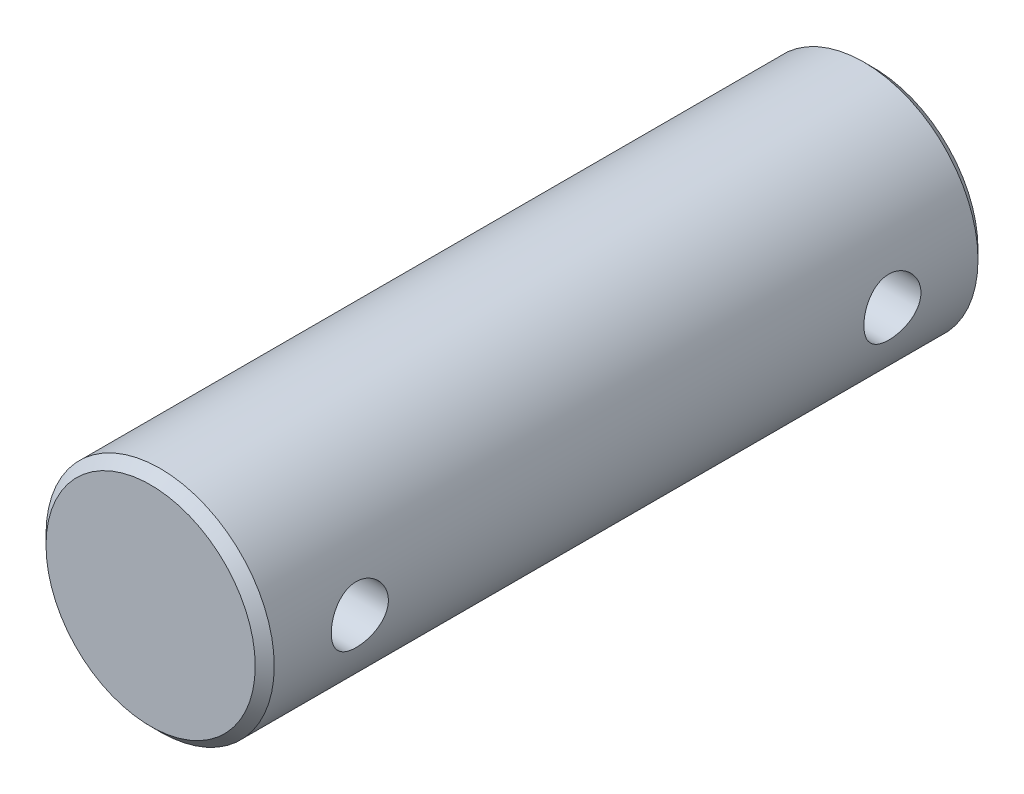
ISO-10303-21;
HEADER;
FILE_DESCRIPTION(('STEP AP214'),'2;1');
FILE_NAME('part.step','',(''),(''),'','','');
FILE_SCHEMA(('AUTOMOTIVE_DESIGN { 1 0 10303 214 1 1 1 1 }'));
ENDSEC;
DATA;
#1=APPLICATION_CONTEXT('core data for automotive mechanical design processes');
#2=APPLICATION_PROTOCOL_DEFINITION('international standard','automotive_design',2000,#1);
#3=PRODUCT_CONTEXT('',#1,'mechanical');
#4=PRODUCT('Part','Part','',(#3));
#5=PRODUCT_RELATED_PRODUCT_CATEGORY('part','',(#4));
#6=PRODUCT_DEFINITION_FORMATION('','',#4);
#7=PRODUCT_DEFINITION_CONTEXT('part definition',#1,'design');
#8=PRODUCT_DEFINITION('design','',#6,#7);
#9=PRODUCT_DEFINITION_SHAPE('','',#8);
#10=(LENGTH_UNIT() NAMED_UNIT(*) SI_UNIT(.MILLI.,.METRE.));
#11=(NAMED_UNIT(*) PLANE_ANGLE_UNIT() SI_UNIT($,.RADIAN.));
#12=(NAMED_UNIT(*) SI_UNIT($,.STERADIAN.) SOLID_ANGLE_UNIT());
#13=UNCERTAINTY_MEASURE_WITH_UNIT(LENGTH_MEASURE(1.E-05),#10,'distance_accuracy_value','');
#14=(GEOMETRIC_REPRESENTATION_CONTEXT(3) GLOBAL_UNCERTAINTY_ASSIGNED_CONTEXT((#13)) GLOBAL_UNIT_ASSIGNED_CONTEXT((#10,
#11,#12)) REPRESENTATION_CONTEXT('',''));
#15=CARTESIAN_POINT('',(0.,0.,0.));
#16=DIRECTION('',(0.,0.,1.));
#17=DIRECTION('',(1.,0.,0.));
#18=AXIS2_PLACEMENT_3D('',#15,#16,#17);
#19=CARTESIAN_POINT('',(0.,0.,-38.));
#20=DIRECTION('',(0.,0.,1.));
#21=DIRECTION('',(1.,0.,0.));
#22=AXIS2_PLACEMENT_3D('',#19,#20,#21);
#23=CYLINDRICAL_SURFACE('',#22,6.);
#24=CARTESIAN_POINT('',(-6.,0.,-6.5));
#25=CARTESIAN_POINT('',(-5.99999859868013,-0.0828760886697311,-6.49999767426184));
#26=CARTESIAN_POINT('',(-5.99826578131828,-0.165778157830763,-6.49310844922621));
#27=CARTESIAN_POINT('',(-5.99152113829892,-0.329206323770533,-6.465774848693));
#28=CARTESIAN_POINT('',(-5.98650745419968,-0.409731046870739,-6.44532279046215));
#29=CARTESIAN_POINT('',(-5.9737562633204,-0.566020872182577,-6.39156074653791));
#30=CARTESIAN_POINT('',(-5.96602202842087,-0.641791563430003,-6.35826620128472));
#31=CARTESIAN_POINT('',(-5.94865343807593,-0.786672131904427,-6.27981860995517));
#32=CARTESIAN_POINT('',(-5.9390190185405,-0.855781784348759,-6.23466516388106));
#33=CARTESIAN_POINT('',(-5.91867413591801,-0.98680192730092,-6.13279921034579));
#34=CARTESIAN_POINT('',(-5.90794707148533,-1.04855569006107,-6.07588842504082));
#35=CARTESIAN_POINT('',(-5.88673620117529,-1.1617489272033,-5.95254779509108));
#36=CARTESIAN_POINT('',(-5.87625242288348,-1.21318723694913,-5.8861168770535));
#37=CARTESIAN_POINT('',(-5.8565477569971,-1.30502654279903,-5.74440477326256));
#38=CARTESIAN_POINT('',(-5.84734794470605,-1.34525221592536,-5.6690067691896));
#39=CARTESIAN_POINT('',(-5.83149494812223,-1.41239690855053,-5.51225158834164));
#40=CARTESIAN_POINT('',(-5.82484135672789,-1.43931805543933,-5.43089536667424));
#41=CARTESIAN_POINT('',(-5.81500476717551,-1.47855483680429,-5.26625650179753));
#42=CARTESIAN_POINT('',(-5.81175491075426,-1.49115226833334,-5.1830451039502));
#43=CARTESIAN_POINT('',(-5.80889362537741,-1.50226177506785,-5.01563143098602));
#44=CARTESIAN_POINT('',(-5.80928160448644,-1.50077614181798,-4.93142931930139));
#45=CARTESIAN_POINT('',(-5.81359205496618,-1.48398652463928,-4.76658419225552));
#46=CARTESIAN_POINT('',(-5.81742863001879,-1.46901834019052,-4.6859043785349));
#47=CARTESIAN_POINT('',(-5.82806709676483,-1.42622418690311,-4.52823894908871));
#48=CARTESIAN_POINT('',(-5.83486919970696,-1.39839730206942,-4.45125359697102));
#49=CARTESIAN_POINT('',(-5.85075113904186,-1.33038947793715,-4.30226198374793));
#50=CARTESIAN_POINT('',(-5.85985327469421,-1.29008666723291,-4.23031382821045));
#51=CARTESIAN_POINT('',(-5.87929710846386,-1.19835627601496,-4.09408129024316));
#52=CARTESIAN_POINT('',(-5.88963902334735,-1.14692674880884,-4.02979825193274));
#53=CARTESIAN_POINT('',(-5.91075880539781,-1.03266342468122,-3.9087963843056));
#54=CARTESIAN_POINT('',(-5.92154069477971,-0.969546258165861,-3.85234550993865));
#55=CARTESIAN_POINT('',(-5.94205965578786,-0.834611917503701,-3.7507787575361));
#56=CARTESIAN_POINT('',(-5.95179669549415,-0.762794477707945,-3.70566322573643));
#57=CARTESIAN_POINT('',(-5.96917732094182,-0.612115888681392,-3.62794941377561));
#58=CARTESIAN_POINT('',(-5.97681360127725,-0.533231393208624,-3.59539465974557));
#59=CARTESIAN_POINT('',(-5.98907916991418,-0.370876008142883,-3.54408269429043));
#60=CARTESIAN_POINT('',(-5.99370903339281,-0.287405999150485,-3.52532284358186));
#61=CARTESIAN_POINT('',(-5.99935499271374,-0.120539970390027,-3.50254243444116));
#62=CARTESIAN_POINT('',(-6.00046053508279,-0.03719671998821,-3.4981569739247));
#63=CARTESIAN_POINT('',(-5.99918804814451,0.129032874801508,-3.50324900205549));
#64=CARTESIAN_POINT('',(-5.99681033241846,0.211919259644595,-3.51272524279913));
#65=CARTESIAN_POINT('',(-5.98889581127357,0.373614268776492,-3.54497090839138));
#66=CARTESIAN_POINT('',(-5.98340634185811,0.452465118968754,-3.56754126347699));
#67=CARTESIAN_POINT('',(-5.96988706634134,0.605257292452511,-3.62510708402845));
#68=CARTESIAN_POINT('',(-5.96185700369892,0.679198119032635,-3.66010380431317));
#69=CARTESIAN_POINT('',(-5.9439330792631,0.821523134429847,-3.74223612887473));
#70=CARTESIAN_POINT('',(-5.93400867366932,0.88978544183583,-3.78957611239676));
#71=CARTESIAN_POINT('',(-5.91344509187419,1.01752661364325,-3.89478990879697));
#72=CARTESIAN_POINT('',(-5.90280579251705,1.07700395897301,-3.95266553961691));
#73=CARTESIAN_POINT('',(-5.88168956960771,1.18699056807273,-4.07900196084446));
#74=CARTESIAN_POINT('',(-5.87122304187281,1.23724386762203,-4.14768770300242));
#75=CARTESIAN_POINT('',(-5.85192878377239,1.3255107590127,-4.29273263446572));
#76=CARTESIAN_POINT('',(-5.84310098067026,1.36352489415794,-4.36909148295975));
#77=CARTESIAN_POINT('',(-5.82818094734665,1.42595142060929,-4.52690572241308));
#78=CARTESIAN_POINT('',(-5.82207255291905,1.45044439665407,-4.60832762834401));
#79=CARTESIAN_POINT('',(-5.81326744090183,1.48534565995378,-4.77430963788911));
#80=CARTESIAN_POINT('',(-5.81056997719936,1.49575702747866,-4.85886905103249));
#81=CARTESIAN_POINT('',(-5.80894901203957,1.50203859033399,-5.0261210238552));
#82=CARTESIAN_POINT('',(-5.80991932728264,1.49831789778012,-5.10879743512473));
#83=CARTESIAN_POINT('',(-5.81527909007843,1.47737727831287,-5.27230388866798));
#84=CARTESIAN_POINT('',(-5.81966846891857,1.46015762268677,-5.35313396801365));
#85=CARTESIAN_POINT('',(-5.83131260682722,1.41293131944279,-5.51020845906541));
#86=CARTESIAN_POINT('',(-5.83855015236309,1.38300140468038,-5.58647730524021));
#87=CARTESIAN_POINT('',(-5.85507755724829,1.31126491360507,-5.73296538271369));
#88=CARTESIAN_POINT('',(-5.86436770120773,1.26945669003419,-5.80318377318692));
#89=CARTESIAN_POINT('',(-5.88425634263512,1.17386774863714,-5.93755462900202));
#90=CARTESIAN_POINT('',(-5.89488264831757,1.11980316291226,-6.00150107342396));
#91=CARTESIAN_POINT('',(-5.91608027246286,1.00178937118974,-6.11954704479541));
#92=CARTESIAN_POINT('',(-5.9266515772706,0.937837821261146,-6.17364423011297));
#93=CARTESIAN_POINT('',(-5.94677655647663,0.800467586702591,-6.27141130856461));
#94=CARTESIAN_POINT('',(-5.95630833365868,0.726898422316387,-6.31487461367158));
#95=CARTESIAN_POINT('',(-5.97304924975118,0.573266059510477,-6.38874746294053));
#96=CARTESIAN_POINT('',(-5.98026005199781,0.49320756343674,-6.41916636064854));
#97=CARTESIAN_POINT('',(-5.99048059565541,0.344410253243472,-6.46157183032965));
#98=CARTESIAN_POINT('',(-5.9940258505269,0.276380170908069,-6.47595124305343));
#99=CARTESIAN_POINT('',(-5.99878605231948,0.138906071536283,-6.49516594362194));
#100=CARTESIAN_POINT('',(-6.00000117450894,0.0694621612426164,-6.5000019493053));
#101=CARTESIAN_POINT('',(-6.,0.,-6.5));
#102=B_SPLINE_CURVE_WITH_KNOTS('',3,(#24,#25,#26,#27,#28,#29,#30,#31,#32,#33,#34,#35,#36,#37,
#38,#39,#40,#41,#42,#43,#44,#45,#46,#47,#48,#49,#50,#51,#52,#53,#54,#55,#56,#57,#58,#59,#60,#61,
#62,#63,#64,#65,#66,#67,#68,#69,#70,#71,#72,#73,#74,#75,#76,#77,#78,#79,#80,#81,#82,#83,#84,#85,
#86,#87,#88,#89,#90,#91,#92,#93,#94,#95,#96,#97,#98,#99,#100,#101),.UNSPECIFIED.,.T.,.F.,(4,2,2,
2,2,2,2,2,2,2,2,2,2,2,2,2,2,2,2,2,2,2,2,2,2,2,2,2,2,2,2,2,2,2,2,2,2,2,4),(0.,0.24837371247189,
0.4968882377639,0.745104902286106,0.993329940169328,1.24614435437139,1.49898729580062,
1.75558647545807,2.01214461169368,2.2635629509943,2.51494038112697,2.76022497007018,
3.00552703466038,3.25330527873879,3.50112690836163,3.75601500969019,4.01091089558247,
4.26668229009114,4.52240473688643,4.77158308949276,5.02073901112743,5.26620274514037,
5.51169127322291,5.76153587565352,6.01142363008019,6.26744509204476,6.52345518749508,
6.77792254614037,7.03233423252408,7.27943780398613,7.52653640956034,7.77216400559447,
8.01782568136901,8.2698957640991,8.52202569770418,8.77872185499588,9.0352336382135,
9.24342242942149,9.4515955604304),.UNSPECIFIED.);
#103=CARTESIAN_POINT('',(-6.,0.,-6.5));
#104=VERTEX_POINT('',#103);
#105=EDGE_CURVE('E10',#104,#104,#102,.T.);
#106=ORIENTED_EDGE('',*,*,#105,.F.);
#107=EDGE_LOOP('',(#106));
#108=FACE_BOUND('',#107,.T.);
#109=CARTESIAN_POINT('',(6.,0.,-6.5));
#110=CARTESIAN_POINT('',(5.99999859868013,0.0828760886697312,-6.49999767426184));
#111=CARTESIAN_POINT('',(5.99826578131828,0.165778157830763,-6.49310844922621));
#112=CARTESIAN_POINT('',(5.99152113829892,0.329206323770533,-6.465774848693));
#113=CARTESIAN_POINT('',(5.98650745419968,0.409731046870739,-6.44532279046215));
#114=CARTESIAN_POINT('',(5.9737562633204,0.566020872182577,-6.39156074653791));
#115=CARTESIAN_POINT('',(5.96602202842087,0.641791563430003,-6.35826620128472));
#116=CARTESIAN_POINT('',(5.94865343807593,0.786672131904427,-6.27981860995517));
#117=CARTESIAN_POINT('',(5.9390190185405,0.855781784348759,-6.23466516388106));
#118=CARTESIAN_POINT('',(5.91867413591801,0.98680192730092,-6.13279921034579));
#119=CARTESIAN_POINT('',(5.90794707148533,1.04855569006107,-6.07588842504082));
#120=CARTESIAN_POINT('',(5.88673620117529,1.1617489272033,-5.95254779509108));
#121=CARTESIAN_POINT('',(5.87625242288348,1.21318723694913,-5.8861168770535));
#122=CARTESIAN_POINT('',(5.8565477569971,1.30502654279903,-5.74440477326256));
#123=CARTESIAN_POINT('',(5.84734794470605,1.34525221592536,-5.6690067691896));
#124=CARTESIAN_POINT('',(5.83149494812223,1.41239690855053,-5.51225158834164));
#125=CARTESIAN_POINT('',(5.82484135672789,1.43931805543933,-5.43089536667424));
#126=CARTESIAN_POINT('',(5.81500476717551,1.47855483680429,-5.26625650179753));
#127=CARTESIAN_POINT('',(5.81175491075426,1.49115226833334,-5.1830451039502));
#128=CARTESIAN_POINT('',(5.80889362537741,1.50226177506785,-5.01563143098602));
#129=CARTESIAN_POINT('',(5.80928160448644,1.50077614181798,-4.93142931930139));
#130=CARTESIAN_POINT('',(5.81359205496618,1.48398652463928,-4.76658419225552));
#131=CARTESIAN_POINT('',(5.81742863001879,1.46901834019052,-4.6859043785349));
#132=CARTESIAN_POINT('',(5.82806709676483,1.42622418690311,-4.52823894908871));
#133=CARTESIAN_POINT('',(5.83486919970696,1.39839730206942,-4.45125359697102));
#134=CARTESIAN_POINT('',(5.85075113904186,1.33038947793715,-4.30226198374793));
#135=CARTESIAN_POINT('',(5.85985327469421,1.29008666723291,-4.23031382821045));
#136=CARTESIAN_POINT('',(5.87929710846386,1.19835627601496,-4.09408129024316));
#137=CARTESIAN_POINT('',(5.88963902334735,1.14692674880884,-4.02979825193274));
#138=CARTESIAN_POINT('',(5.91075880539781,1.03266342468122,-3.9087963843056));
#139=CARTESIAN_POINT('',(5.92154069477971,0.969546258165861,-3.85234550993865));
#140=CARTESIAN_POINT('',(5.94205965578786,0.834611917503701,-3.7507787575361));
#141=CARTESIAN_POINT('',(5.95179669549415,0.762794477707945,-3.70566322573643));
#142=CARTESIAN_POINT('',(5.96917732094182,0.612115888681392,-3.62794941377561));
#143=CARTESIAN_POINT('',(5.97681360127725,0.533231393208624,-3.59539465974557));
#144=CARTESIAN_POINT('',(5.98907916991418,0.370876008142883,-3.54408269429043));
#145=CARTESIAN_POINT('',(5.99370903339281,0.287405999150485,-3.52532284358186));
#146=CARTESIAN_POINT('',(5.99935499271374,0.120539970390027,-3.50254243444116));
#147=CARTESIAN_POINT('',(6.00046053508279,0.03719671998821,-3.4981569739247));
#148=CARTESIAN_POINT('',(5.99918804814451,-0.129032874801508,-3.50324900205549));
#149=CARTESIAN_POINT('',(5.99681033241846,-0.211919259644595,-3.51272524279913));
#150=CARTESIAN_POINT('',(5.98889581127357,-0.373614268776492,-3.54497090839138));
#151=CARTESIAN_POINT('',(5.98340634185811,-0.452465118968754,-3.56754126347699));
#152=CARTESIAN_POINT('',(5.96988706634134,-0.605257292452511,-3.62510708402845));
#153=CARTESIAN_POINT('',(5.96185700369892,-0.679198119032635,-3.66010380431317));
#154=CARTESIAN_POINT('',(5.9439330792631,-0.821523134429847,-3.74223612887473));
#155=CARTESIAN_POINT('',(5.93400867366932,-0.88978544183583,-3.78957611239676));
#156=CARTESIAN_POINT('',(5.91344509187419,-1.01752661364325,-3.89478990879697));
#157=CARTESIAN_POINT('',(5.90280579251705,-1.07700395897301,-3.95266553961691));
#158=CARTESIAN_POINT('',(5.88168956960771,-1.18699056807273,-4.07900196084446));
#159=CARTESIAN_POINT('',(5.87122304187281,-1.23724386762203,-4.14768770300242));
#160=CARTESIAN_POINT('',(5.85192878377239,-1.3255107590127,-4.29273263446572));
#161=CARTESIAN_POINT('',(5.84310098067026,-1.36352489415794,-4.36909148295975));
#162=CARTESIAN_POINT('',(5.82818094734665,-1.42595142060929,-4.52690572241308));
#163=CARTESIAN_POINT('',(5.82207255291905,-1.45044439665407,-4.60832762834401));
#164=CARTESIAN_POINT('',(5.81326744090183,-1.48534565995378,-4.77430963788911));
#165=CARTESIAN_POINT('',(5.81056997719936,-1.49575702747866,-4.85886905103249));
#166=CARTESIAN_POINT('',(5.80894901203957,-1.50203859033399,-5.0261210238552));
#167=CARTESIAN_POINT('',(5.80991932728264,-1.49831789778012,-5.10879743512473));
#168=CARTESIAN_POINT('',(5.81527909007843,-1.47737727831287,-5.27230388866798));
#169=CARTESIAN_POINT('',(5.81966846891857,-1.46015762268677,-5.35313396801365));
#170=CARTESIAN_POINT('',(5.83131260682722,-1.41293131944279,-5.51020845906541));
#171=CARTESIAN_POINT('',(5.83855015236309,-1.38300140468038,-5.58647730524021));
#172=CARTESIAN_POINT('',(5.85507755724829,-1.31126491360507,-5.73296538271369));
#173=CARTESIAN_POINT('',(5.86436770120773,-1.26945669003419,-5.80318377318692));
#174=CARTESIAN_POINT('',(5.88425634263512,-1.17386774863714,-5.93755462900202));
#175=CARTESIAN_POINT('',(5.89488264831757,-1.11980316291226,-6.00150107342396));
#176=CARTESIAN_POINT('',(5.91608027246286,-1.00178937118974,-6.11954704479541));
#177=CARTESIAN_POINT('',(5.9266515772706,-0.937837821261146,-6.17364423011297));
#178=CARTESIAN_POINT('',(5.94677655647663,-0.800467586702591,-6.27141130856461));
#179=CARTESIAN_POINT('',(5.95630833365868,-0.726898422316387,-6.31487461367158));
#180=CARTESIAN_POINT('',(5.97304924975118,-0.573266059510476,-6.38874746294053));
#181=CARTESIAN_POINT('',(5.98026005199781,-0.49320756343674,-6.41916636064854));
#182=CARTESIAN_POINT('',(5.99048059565541,-0.344410253243472,-6.46157183032965));
#183=CARTESIAN_POINT('',(5.9940258505269,-0.276380170908069,-6.47595124305343));
#184=CARTESIAN_POINT('',(5.99878605231948,-0.138906071536284,-6.49516594362194));
#185=CARTESIAN_POINT('',(6.00000117450894,-0.0694621612426165,-6.5000019493053));
#186=CARTESIAN_POINT('',(6.,0.,-6.5));
#187=B_SPLINE_CURVE_WITH_KNOTS('',3,(#109,#110,#111,#112,#113,#114,#115,#116,#117,#118,#119,
#120,#121,#122,#123,#124,#125,#126,#127,#128,#129,#130,#131,#132,#133,#134,#135,#136,#137,#138,
#139,#140,#141,#142,#143,#144,#145,#146,#147,#148,#149,#150,#151,#152,#153,#154,#155,#156,#157,
#158,#159,#160,#161,#162,#163,#164,#165,#166,#167,#168,#169,#170,#171,#172,#173,#174,#175,#176,
#177,#178,#179,#180,#181,#182,#183,#184,#185,#186),.UNSPECIFIED.,.T.,.F.,(4,2,2,2,2,2,2,2,2,2,2,
2,2,2,2,2,2,2,2,2,2,2,2,2,2,2,2,2,2,2,2,2,2,2,2,2,2,2,4),(0.,0.24837371247189,0.496888237763899,
0.745104902286106,0.993329940169328,1.24614435437139,1.49898729580062,1.75558647545807,
2.01214461169368,2.2635629509943,2.51494038112697,2.76022497007018,3.00552703466038,
3.25330527873879,3.50112690836163,3.75601500969019,4.01091089558247,4.26668229009114,
4.52240473688643,4.77158308949276,5.02073901112743,5.26620274514037,5.51169127322291,
5.76153587565352,6.01142363008019,6.26744509204476,6.52345518749508,6.77792254614037,
7.03233423252408,7.27943780398613,7.52653640956034,7.77216400559447,8.01782568136901,
8.2698957640991,8.52202569770418,8.77872185499588,9.0352336382135,9.24342242942149,
9.4515955604304),.UNSPECIFIED.);
#188=CARTESIAN_POINT('',(6.,0.,-6.5));
#189=VERTEX_POINT('',#188);
#190=EDGE_CURVE('E53',#189,#189,#187,.T.);
#191=ORIENTED_EDGE('',*,*,#190,.F.);
#192=EDGE_LOOP('',(#191));
#193=FACE_BOUND('',#192,.T.);
#194=CARTESIAN_POINT('',(-6.,0.,-34.5));
#195=CARTESIAN_POINT('',(-5.99999859868013,-0.0828760886697313,-34.4999976742618));
#196=CARTESIAN_POINT('',(-5.99826578131828,-0.165778157830763,-34.4931084492262));
#197=CARTESIAN_POINT('',(-5.99152113829892,-0.329206323770533,-34.465774848693));
#198=CARTESIAN_POINT('',(-5.98650745419968,-0.40973104687074,-34.4453227904622));
#199=CARTESIAN_POINT('',(-5.9737562633204,-0.566020872182578,-34.3915607465379));
#200=CARTESIAN_POINT('',(-5.96602202842087,-0.641791563430005,-34.3582662012847));
#201=CARTESIAN_POINT('',(-5.94865343807593,-0.786672131904429,-34.2798186099552));
#202=CARTESIAN_POINT('',(-5.9390190185405,-0.855781784348762,-34.2346651638811));
#203=CARTESIAN_POINT('',(-5.91867413591801,-0.986801927300925,-34.1327992103458));
#204=CARTESIAN_POINT('',(-5.90794707148533,-1.04855569006108,-34.0758884250408));
#205=CARTESIAN_POINT('',(-5.88673620117529,-1.16174892720331,-33.9525477950911));
#206=CARTESIAN_POINT('',(-5.87625242288348,-1.21318723694914,-33.8861168770535));
#207=CARTESIAN_POINT('',(-5.8565477569971,-1.30502654279904,-33.7444047732626));
#208=CARTESIAN_POINT('',(-5.84734794470605,-1.34525221592536,-33.6690067691896));
#209=CARTESIAN_POINT('',(-5.83149494812223,-1.41239690855053,-33.5122515883416));
#210=CARTESIAN_POINT('',(-5.82484135672789,-1.43931805543934,-33.4308953666742));
#211=CARTESIAN_POINT('',(-5.81500476717551,-1.47855483680429,-33.2662565017975));
#212=CARTESIAN_POINT('',(-5.81175491075426,-1.49115226833334,-33.1830451039502));
#213=CARTESIAN_POINT('',(-5.80889362537741,-1.50226177506786,-33.015631430986));
#214=CARTESIAN_POINT('',(-5.80928160448644,-1.50077614181798,-32.9314293193014));
#215=CARTESIAN_POINT('',(-5.81359205496618,-1.48398652463928,-32.7665841922555));
#216=CARTESIAN_POINT('',(-5.81742863001879,-1.46901834019053,-32.6859043785349));
#217=CARTESIAN_POINT('',(-5.82806709676483,-1.42622418690311,-32.5282389490887));
#218=CARTESIAN_POINT('',(-5.83486919970696,-1.39839730206943,-32.451253596971));
#219=CARTESIAN_POINT('',(-5.85075113904186,-1.33038947793716,-32.3022619837479));
#220=CARTESIAN_POINT('',(-5.85985327469421,-1.29008666723291,-32.2303138282104));
#221=CARTESIAN_POINT('',(-5.87929710846386,-1.19835627601496,-32.0940812902432));
#222=CARTESIAN_POINT('',(-5.88963902334735,-1.14692674880884,-32.0297982519327));
#223=CARTESIAN_POINT('',(-5.91075880539781,-1.03266342468122,-31.9087963843056));
#224=CARTESIAN_POINT('',(-5.92154069477971,-0.969546258165863,-31.8523455099387));
#225=CARTESIAN_POINT('',(-5.94205965578786,-0.834611917503706,-31.7507787575361));
#226=CARTESIAN_POINT('',(-5.95179669549415,-0.76279447770795,-31.7056632257364));
#227=CARTESIAN_POINT('',(-5.96917732094182,-0.612115888681399,-31.6279494137756));
#228=CARTESIAN_POINT('',(-5.97681360127725,-0.53323139320863,-31.5953946597456));
#229=CARTESIAN_POINT('',(-5.98907916991418,-0.370876008142888,-31.5440826942904));
#230=CARTESIAN_POINT('',(-5.99370903339281,-0.287405999150488,-31.5253228435819));
#231=CARTESIAN_POINT('',(-5.99935499271374,-0.120539970390028,-31.5025424344412));
#232=CARTESIAN_POINT('',(-6.00046053508279,-0.0371967199882104,-31.4981569739247));
#233=CARTESIAN_POINT('',(-5.99918804814451,0.129032874801508,-31.5032490020555));
#234=CARTESIAN_POINT('',(-5.99681033241846,0.211919259644594,-31.5127252427991));
#235=CARTESIAN_POINT('',(-5.98889581127357,0.373614268776491,-31.5449709083914));
#236=CARTESIAN_POINT('',(-5.98340634185811,0.452465118968755,-31.567541263477));
#237=CARTESIAN_POINT('',(-5.96988706634134,0.605257292452512,-31.6251070840284));
#238=CARTESIAN_POINT('',(-5.96185700369892,0.679198119032635,-31.6601038043132));
#239=CARTESIAN_POINT('',(-5.9439330792631,0.821523134429848,-31.7422361288747));
#240=CARTESIAN_POINT('',(-5.93400867366932,0.889785441835831,-31.7895761123968));
#241=CARTESIAN_POINT('',(-5.91344509187419,1.01752661364325,-31.894789908797));
#242=CARTESIAN_POINT('',(-5.90280579251705,1.07700395897301,-31.9526655396169));
#243=CARTESIAN_POINT('',(-5.88168956960771,1.18699056807273,-32.0790019608445));
#244=CARTESIAN_POINT('',(-5.87122304187281,1.23724386762204,-32.1476877030024));
#245=CARTESIAN_POINT('',(-5.85192878377239,1.3255107590127,-32.2927326344657));
#246=CARTESIAN_POINT('',(-5.84310098067026,1.36352489415794,-32.3690914829598));
#247=CARTESIAN_POINT('',(-5.82818094734665,1.4259514206093,-32.5269057224131));
#248=CARTESIAN_POINT('',(-5.82207255291905,1.45044439665407,-32.608327628344));
#249=CARTESIAN_POINT('',(-5.81326744090183,1.48534565995378,-32.7743096378891));
#250=CARTESIAN_POINT('',(-5.81056997719936,1.49575702747866,-32.8588690510325));
#251=CARTESIAN_POINT('',(-5.80894901203957,1.502038590334,-33.0261210238552));
#252=CARTESIAN_POINT('',(-5.80991932728264,1.49831789778012,-33.1087974351247));
#253=CARTESIAN_POINT('',(-5.81527909007843,1.47737727831287,-33.272303888668));
#254=CARTESIAN_POINT('',(-5.81966846891857,1.46015762268677,-33.3531339680137));
#255=CARTESIAN_POINT('',(-5.83131260682722,1.4129313194428,-33.5102084590654));
#256=CARTESIAN_POINT('',(-5.83855015236309,1.38300140468038,-33.5864773052402));
#257=CARTESIAN_POINT('',(-5.85507755724828,1.31126491360508,-33.7329653827137));
#258=CARTESIAN_POINT('',(-5.86436770120773,1.26945669003419,-33.8031837731869));
#259=CARTESIAN_POINT('',(-5.88425634263512,1.17386774863714,-33.937554629002));
#260=CARTESIAN_POINT('',(-5.89488264831757,1.11980316291226,-34.001501073424));
#261=CARTESIAN_POINT('',(-5.91608027246285,1.00178937118974,-34.1195470447954));
#262=CARTESIAN_POINT('',(-5.92665157727059,0.937837821261149,-34.173644230113));
#263=CARTESIAN_POINT('',(-5.94677655647663,0.80046758670259,-34.2714113085646));
#264=CARTESIAN_POINT('',(-5.95630833365868,0.726898422316385,-34.3148746136716));
#265=CARTESIAN_POINT('',(-5.97304924975118,0.573266059510475,-34.3887474629405));
#266=CARTESIAN_POINT('',(-5.98026005199781,0.49320756343674,-34.4191663606485));
#267=CARTESIAN_POINT('',(-5.99048059565541,0.344410253243474,-34.4615718303297));
#268=CARTESIAN_POINT('',(-5.9940258505269,0.27638017090807,-34.4759512430534));
#269=CARTESIAN_POINT('',(-5.99878605231948,0.138906071536284,-34.4951659436219));
#270=CARTESIAN_POINT('',(-6.00000117450894,0.0694621612426168,-34.5000019493053));
#271=CARTESIAN_POINT('',(-6.,0.,-34.5));
#272=B_SPLINE_CURVE_WITH_KNOTS('',3,(#194,#195,#196,#197,#198,#199,#200,#201,#202,#203,#204,
#205,#206,#207,#208,#209,#210,#211,#212,#213,#214,#215,#216,#217,#218,#219,#220,#221,#222,#223,
#224,#225,#226,#227,#228,#229,#230,#231,#232,#233,#234,#235,#236,#237,#238,#239,#240,#241,#242,
#243,#244,#245,#246,#247,#248,#249,#250,#251,#252,#253,#254,#255,#256,#257,#258,#259,#260,#261,
#262,#263,#264,#265,#266,#267,#268,#269,#270,#271),.UNSPECIFIED.,.T.,.F.,(4,2,2,2,2,2,2,2,2,2,2,
2,2,2,2,2,2,2,2,2,2,2,2,2,2,2,2,2,2,2,2,2,2,2,2,2,2,2,4),(0.,0.24837371247189,0.496888237763901,
0.745104902286107,0.99332994016933,1.2461443543714,1.49898729580062,1.75558647545807,
2.01214461169369,2.2635629509943,2.51494038112697,2.76022497007019,3.00552703466039,
3.2533052787388,3.50112690836164,3.7560150096902,4.01091089558247,4.26668229009115,
4.52240473688644,4.77158308949277,5.02073901112744,5.26620274514038,5.51169127322292,
5.76153587565353,6.0114236300802,6.26744509204477,6.5234551874951,6.77792254614038,
7.0323342325241,7.27943780398615,7.52653640956036,7.77216400559449,8.01782568136903,
8.26989576409911,8.5220256977042,8.77872185499591,9.03523363821352,9.24342242942151,
9.45159556043042),.UNSPECIFIED.);
#273=CARTESIAN_POINT('',(-6.,0.,-34.5));
#274=VERTEX_POINT('',#273);
#275=EDGE_CURVE('E58',#274,#274,#272,.T.);
#276=ORIENTED_EDGE('',*,*,#275,.F.);
#277=EDGE_LOOP('',(#276));
#278=FACE_BOUND('',#277,.T.);
#279=CARTESIAN_POINT('',(6.,0.,-34.5));
#280=CARTESIAN_POINT('',(5.99999859868013,0.0828760886697313,-34.4999976742618));
#281=CARTESIAN_POINT('',(5.99826578131828,0.165778157830763,-34.4931084492262));
#282=CARTESIAN_POINT('',(5.99152113829892,0.329206323770533,-34.465774848693));
#283=CARTESIAN_POINT('',(5.98650745419968,0.40973104687074,-34.4453227904622));
#284=CARTESIAN_POINT('',(5.9737562633204,0.566020872182578,-34.3915607465379));
#285=CARTESIAN_POINT('',(5.96602202842087,0.641791563430005,-34.3582662012847));
#286=CARTESIAN_POINT('',(5.94865343807593,0.786672131904429,-34.2798186099552));
#287=CARTESIAN_POINT('',(5.9390190185405,0.855781784348762,-34.2346651638811));
#288=CARTESIAN_POINT('',(5.91867413591801,0.986801927300925,-34.1327992103458));
#289=CARTESIAN_POINT('',(5.90794707148533,1.04855569006108,-34.0758884250408));
#290=CARTESIAN_POINT('',(5.88673620117529,1.16174892720331,-33.9525477950911));
#291=CARTESIAN_POINT('',(5.87625242288348,1.21318723694914,-33.8861168770535));
#292=CARTESIAN_POINT('',(5.8565477569971,1.30502654279904,-33.7444047732626));
#293=CARTESIAN_POINT('',(5.84734794470605,1.34525221592536,-33.6690067691896));
#294=CARTESIAN_POINT('',(5.83149494812223,1.41239690855053,-33.5122515883416));
#295=CARTESIAN_POINT('',(5.82484135672789,1.43931805543934,-33.4308953666742));
#296=CARTESIAN_POINT('',(5.81500476717551,1.47855483680429,-33.2662565017975));
#297=CARTESIAN_POINT('',(5.81175491075426,1.49115226833334,-33.1830451039502));
#298=CARTESIAN_POINT('',(5.80889362537741,1.50226177506786,-33.015631430986));
#299=CARTESIAN_POINT('',(5.80928160448644,1.50077614181798,-32.9314293193014));
#300=CARTESIAN_POINT('',(5.81359205496618,1.48398652463928,-32.7665841922555));
#301=CARTESIAN_POINT('',(5.81742863001879,1.46901834019053,-32.6859043785349));
#302=CARTESIAN_POINT('',(5.82806709676483,1.42622418690311,-32.5282389490887));
#303=CARTESIAN_POINT('',(5.83486919970696,1.39839730206943,-32.451253596971));
#304=CARTESIAN_POINT('',(5.85075113904186,1.33038947793716,-32.3022619837479));
#305=CARTESIAN_POINT('',(5.85985327469421,1.29008666723291,-32.2303138282104));
#306=CARTESIAN_POINT('',(5.87929710846386,1.19835627601496,-32.0940812902432));
#307=CARTESIAN_POINT('',(5.88963902334735,1.14692674880884,-32.0297982519327));
#308=CARTESIAN_POINT('',(5.91075880539781,1.03266342468122,-31.9087963843056));
#309=CARTESIAN_POINT('',(5.92154069477971,0.969546258165863,-31.8523455099387));
#310=CARTESIAN_POINT('',(5.94205965578786,0.834611917503706,-31.7507787575361));
#311=CARTESIAN_POINT('',(5.95179669549415,0.76279447770795,-31.7056632257364));
#312=CARTESIAN_POINT('',(5.96917732094182,0.612115888681399,-31.6279494137756));
#313=CARTESIAN_POINT('',(5.97681360127725,0.53323139320863,-31.5953946597456));
#314=CARTESIAN_POINT('',(5.98907916991418,0.370876008142888,-31.5440826942904));
#315=CARTESIAN_POINT('',(5.99370903339281,0.287405999150488,-31.5253228435819));
#316=CARTESIAN_POINT('',(5.99935499271374,0.120539970390028,-31.5025424344412));
#317=CARTESIAN_POINT('',(6.00046053508279,0.0371967199882104,-31.4981569739247));
#318=CARTESIAN_POINT('',(5.99918804814451,-0.129032874801508,-31.5032490020555));
#319=CARTESIAN_POINT('',(5.99681033241846,-0.211919259644594,-31.5127252427991));
#320=CARTESIAN_POINT('',(5.98889581127357,-0.373614268776491,-31.5449709083914));
#321=CARTESIAN_POINT('',(5.98340634185811,-0.452465118968755,-31.567541263477));
#322=CARTESIAN_POINT('',(5.96988706634134,-0.605257292452512,-31.6251070840284));
#323=CARTESIAN_POINT('',(5.96185700369892,-0.679198119032635,-31.6601038043132));
#324=CARTESIAN_POINT('',(5.9439330792631,-0.821523134429848,-31.7422361288747));
#325=CARTESIAN_POINT('',(5.93400867366932,-0.889785441835831,-31.7895761123968));
#326=CARTESIAN_POINT('',(5.91344509187419,-1.01752661364325,-31.894789908797));
#327=CARTESIAN_POINT('',(5.90280579251705,-1.07700395897301,-31.9526655396169));
#328=CARTESIAN_POINT('',(5.88168956960771,-1.18699056807273,-32.0790019608445));
#329=CARTESIAN_POINT('',(5.87122304187281,-1.23724386762204,-32.1476877030024));
#330=CARTESIAN_POINT('',(5.85192878377239,-1.3255107590127,-32.2927326344657));
#331=CARTESIAN_POINT('',(5.84310098067026,-1.36352489415794,-32.3690914829598));
#332=CARTESIAN_POINT('',(5.82818094734665,-1.4259514206093,-32.5269057224131));
#333=CARTESIAN_POINT('',(5.82207255291905,-1.45044439665407,-32.608327628344));
#334=CARTESIAN_POINT('',(5.81326744090183,-1.48534565995378,-32.7743096378891));
#335=CARTESIAN_POINT('',(5.81056997719936,-1.49575702747866,-32.8588690510325));
#336=CARTESIAN_POINT('',(5.80894901203957,-1.502038590334,-33.0261210238552));
#337=CARTESIAN_POINT('',(5.80991932728264,-1.49831789778012,-33.1087974351247));
#338=CARTESIAN_POINT('',(5.81527909007843,-1.47737727831287,-33.272303888668));
#339=CARTESIAN_POINT('',(5.81966846891857,-1.46015762268677,-33.3531339680137));
#340=CARTESIAN_POINT('',(5.83131260682722,-1.4129313194428,-33.5102084590654));
#341=CARTESIAN_POINT('',(5.83855015236309,-1.38300140468038,-33.5864773052402));
#342=CARTESIAN_POINT('',(5.85507755724828,-1.31126491360508,-33.7329653827137));
#343=CARTESIAN_POINT('',(5.86436770120773,-1.26945669003419,-33.8031837731869));
#344=CARTESIAN_POINT('',(5.88425634263512,-1.17386774863714,-33.937554629002));
#345=CARTESIAN_POINT('',(5.89488264831757,-1.11980316291226,-34.001501073424));
#346=CARTESIAN_POINT('',(5.91608027246285,-1.00178937118974,-34.1195470447954));
#347=CARTESIAN_POINT('',(5.92665157727059,-0.937837821261149,-34.173644230113));
#348=CARTESIAN_POINT('',(5.94677655647663,-0.80046758670259,-34.2714113085646));
#349=CARTESIAN_POINT('',(5.95630833365868,-0.726898422316385,-34.3148746136716));
#350=CARTESIAN_POINT('',(5.97304924975118,-0.573266059510475,-34.3887474629405));
#351=CARTESIAN_POINT('',(5.98026005199781,-0.49320756343674,-34.4191663606485));
#352=CARTESIAN_POINT('',(5.99048059565541,-0.344410253243474,-34.4615718303297));
#353=CARTESIAN_POINT('',(5.9940258505269,-0.27638017090807,-34.4759512430534));
#354=CARTESIAN_POINT('',(5.99878605231948,-0.138906071536284,-34.4951659436219));
#355=CARTESIAN_POINT('',(6.00000117450894,-0.0694621612426168,-34.5000019493053));
#356=CARTESIAN_POINT('',(6.,0.,-34.5));
#357=B_SPLINE_CURVE_WITH_KNOTS('',3,(#279,#280,#281,#282,#283,#284,#285,#286,#287,#288,#289,
#290,#291,#292,#293,#294,#295,#296,#297,#298,#299,#300,#301,#302,#303,#304,#305,#306,#307,#308,
#309,#310,#311,#312,#313,#314,#315,#316,#317,#318,#319,#320,#321,#322,#323,#324,#325,#326,#327,
#328,#329,#330,#331,#332,#333,#334,#335,#336,#337,#338,#339,#340,#341,#342,#343,#344,#345,#346,
#347,#348,#349,#350,#351,#352,#353,#354,#355,#356),.UNSPECIFIED.,.T.,.F.,(4,2,2,2,2,2,2,2,2,2,2,
2,2,2,2,2,2,2,2,2,2,2,2,2,2,2,2,2,2,2,2,2,2,2,2,2,2,2,4),(0.,0.24837371247189,0.496888237763901,
0.745104902286107,0.99332994016933,1.2461443543714,1.49898729580062,1.75558647545807,
2.01214461169369,2.2635629509943,2.51494038112697,2.76022497007019,3.00552703466039,
3.2533052787388,3.50112690836164,3.7560150096902,4.01091089558247,4.26668229009115,
4.52240473688644,4.77158308949277,5.02073901112744,5.26620274514038,5.51169127322292,
5.76153587565353,6.0114236300802,6.26744509204477,6.5234551874951,6.77792254614038,
7.0323342325241,7.27943780398615,7.52653640956036,7.77216400559449,8.01782568136903,
8.26989576409911,8.5220256977042,8.77872185499591,9.03523363821352,9.24342242942151,
9.45159556043042),.UNSPECIFIED.);
#358=CARTESIAN_POINT('',(6.,0.,-34.5));
#359=VERTEX_POINT('',#358);
#360=EDGE_CURVE('E63',#359,#359,#357,.T.);
#361=ORIENTED_EDGE('',*,*,#360,.F.);
#362=EDGE_LOOP('',(#361));
#363=FACE_BOUND('',#362,.T.);
#364=CARTESIAN_POINT('',(0.,0.,-37.5));
#365=DIRECTION('',(0.,0.,1.));
#366=DIRECTION('',(1.,0.,0.));
#367=AXIS2_PLACEMENT_3D('',#364,#365,#366);
#368=CIRCLE('',#367,6.);
#369=CARTESIAN_POINT('',(6.,0.,-37.5));
#370=VERTEX_POINT('',#369);
#371=EDGE_CURVE('E100',#370,#370,#368,.T.);
#372=ORIENTED_EDGE('',*,*,#371,.T.);
#373=EDGE_LOOP('',(#372));
#374=FACE_BOUND('',#373,.T.);
#375=CARTESIAN_POINT('',(0.,0.,-0.500000000000007));
#376=DIRECTION('',(0.,0.,1.));
#377=DIRECTION('',(1.,0.,0.));
#378=AXIS2_PLACEMENT_3D('',#375,#376,#377);
#379=CIRCLE('',#378,6.);
#380=CARTESIAN_POINT('',(6.,0.,-0.500000000000007));
#381=VERTEX_POINT('',#380);
#382=EDGE_CURVE('E104',#381,#381,#379,.F.);
#383=ORIENTED_EDGE('',*,*,#382,.T.);
#384=EDGE_LOOP('',(#383));
#385=FACE_BOUND('',#384,.T.);
#386=ADVANCED_FACE('F39',(#108,#193,#278,#363,#374,#385),#23,.T.);
#387=CARTESIAN_POINT('',(0.,0.,-38.));
#388=DIRECTION('',(0.,0.,1.));
#389=DIRECTION('',(1.,0.,0.));
#390=AXIS2_PLACEMENT_3D('',#387,#388,#389);
#391=PLANE('',#390);
#392=CARTESIAN_POINT('',(0.,0.,-38.));
#393=DIRECTION('',(0.,0.,1.));
#394=DIRECTION('',(1.,0.,0.));
#395=AXIS2_PLACEMENT_3D('',#392,#393,#394);
#396=CIRCLE('',#395,5.49999999999999);
#397=CARTESIAN_POINT('',(5.49999999999999,0.,-38.));
#398=VERTEX_POINT('',#397);
#399=EDGE_CURVE('E96',#398,#398,#396,.F.);
#400=ORIENTED_EDGE('',*,*,#399,.T.);
#401=EDGE_LOOP('',(#400));
#402=FACE_BOUND('',#401,.T.);
#403=ADVANCED_FACE('F84',(#402),#391,.F.);
#404=CARTESIAN_POINT('',(0.,0.,0.));
#405=DIRECTION('',(0.,0.,1.));
#406=DIRECTION('',(1.,0.,0.));
#407=AXIS2_PLACEMENT_3D('',#404,#405,#406);
#408=PLANE('',#407);
#409=CARTESIAN_POINT('',(0.,0.,0.));
#410=DIRECTION('',(0.,0.,1.));
#411=DIRECTION('',(1.,0.,0.));
#412=AXIS2_PLACEMENT_3D('',#409,#410,#411);
#413=CIRCLE('',#412,5.5);
#414=CARTESIAN_POINT('',(5.5,0.,0.));
#415=VERTEX_POINT('',#414);
#416=EDGE_CURVE('E92',#415,#415,#413,.T.);
#417=ORIENTED_EDGE('',*,*,#416,.T.);
#418=EDGE_LOOP('',(#417));
#419=FACE_BOUND('',#418,.T.);
#420=ADVANCED_FACE('F115',(#419),#408,.T.);
#421=CARTESIAN_POINT('',(0.,0.,-37.5));
#422=DIRECTION('',(0.,0.,1.));
#423=DIRECTION('',(1.,0.,0.));
#424=AXIS2_PLACEMENT_3D('',#421,#422,#423);
#425=CONICAL_SURFACE('',#424,6.,0.785398163397449);
#426=ORIENTED_EDGE('',*,*,#399,.F.);
#427=EDGE_LOOP('',(#426));
#428=FACE_BOUND('',#427,.T.);
#429=ORIENTED_EDGE('',*,*,#371,.F.);
#430=EDGE_LOOP('',(#429));
#431=FACE_BOUND('',#430,.T.);
#432=ADVANCED_FACE('F112',(#428,#431),#425,.T.);
#433=CARTESIAN_POINT('',(0.,0.,0.));
#434=DIRECTION('',(0.,0.,-1.));
#435=DIRECTION('',(-1.,0.,0.));
#436=AXIS2_PLACEMENT_3D('',#433,#434,#435);
#437=CONICAL_SURFACE('',#436,5.5,0.785398163397439);
#438=ORIENTED_EDGE('',*,*,#382,.F.);
#439=EDGE_LOOP('',(#438));
#440=FACE_BOUND('',#439,.T.);
#441=ORIENTED_EDGE('',*,*,#416,.F.);
#442=EDGE_LOOP('',(#441));
#443=FACE_BOUND('',#442,.T.);
#444=ADVANCED_FACE('F42',(#440,#443),#437,.T.);
#445=CARTESIAN_POINT('',(-6.,0.,-33.));
#446=DIRECTION('',(1.,0.,0.));
#447=DIRECTION('',(0.,0.,-1.));
#448=AXIS2_PLACEMENT_3D('',#445,#446,#447);
#449=CYLINDRICAL_SURFACE('',#448,1.5);
#450=ORIENTED_EDGE('',*,*,#360,.T.);
#451=EDGE_LOOP('',(#450));
#452=FACE_BOUND('',#451,.T.);
#453=ORIENTED_EDGE('',*,*,#275,.T.);
#454=EDGE_LOOP('',(#453));
#455=FACE_BOUND('',#454,.T.);
#456=ADVANCED_FACE('F78',(#452,#455),#449,.F.);
#457=CARTESIAN_POINT('',(-6.,0.,-5.));
#458=DIRECTION('',(1.,0.,0.));
#459=DIRECTION('',(0.,0.,-1.));
#460=AXIS2_PLACEMENT_3D('',#457,#458,#459);
#461=CYLINDRICAL_SURFACE('',#460,1.5);
#462=ORIENTED_EDGE('',*,*,#190,.T.);
#463=EDGE_LOOP('',(#462));
#464=FACE_BOUND('',#463,.T.);
#465=ORIENTED_EDGE('',*,*,#105,.T.);
#466=EDGE_LOOP('',(#465));
#467=FACE_BOUND('',#466,.T.);
#468=ADVANCED_FACE('F75',(#464,#467),#461,.F.);
#469=CLOSED_SHELL('',(#386,#403,#420,#432,#444,#456,#468));
#470=MANIFOLD_SOLID_BREP('B2',#469);
#471=ADVANCED_BREP_SHAPE_REPRESENTATION('',(#18,#470),#14);
#472=SHAPE_DEFINITION_REPRESENTATION(#9,#471);
ENDSEC;
END-ISO-10303-21;
